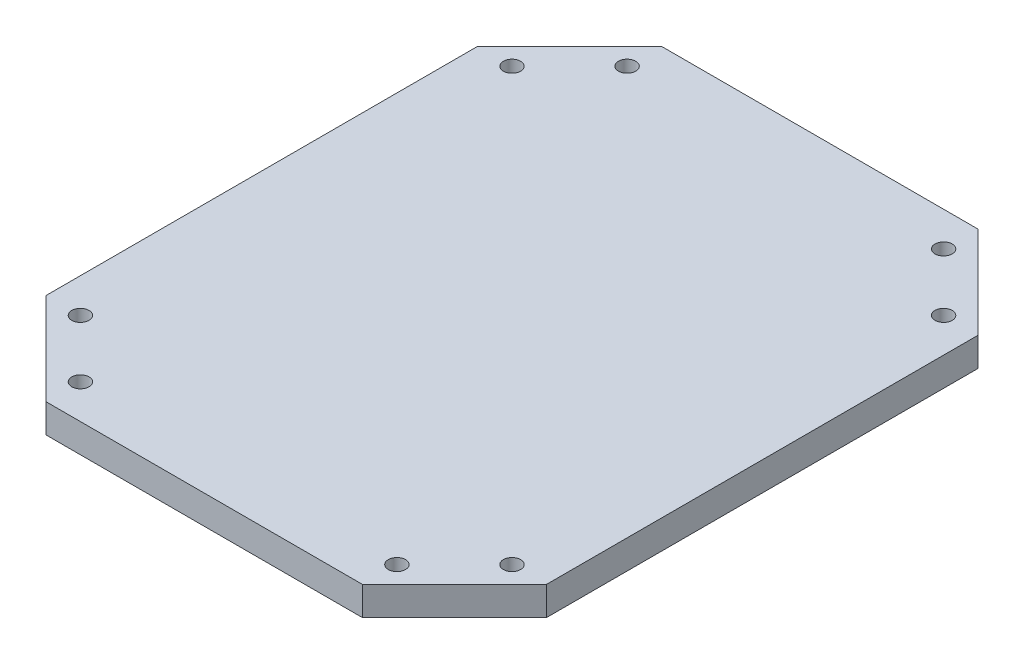
ISO-10303-21;
HEADER;
FILE_DESCRIPTION(('STEP AP214'),'2;1');
FILE_NAME('part.step','',(''),(''),'','','');
FILE_SCHEMA(('AUTOMOTIVE_DESIGN { 1 0 10303 214 1 1 1 1 }'));
ENDSEC;
DATA;
#1=APPLICATION_CONTEXT('core data for automotive mechanical design processes');
#2=APPLICATION_PROTOCOL_DEFINITION('international standard','automotive_design',2000,#1);
#3=PRODUCT_CONTEXT('',#1,'mechanical');
#4=PRODUCT('Part','Part','',(#3));
#5=PRODUCT_RELATED_PRODUCT_CATEGORY('part','',(#4));
#6=PRODUCT_DEFINITION_FORMATION('','',#4);
#7=PRODUCT_DEFINITION_CONTEXT('part definition',#1,'design');
#8=PRODUCT_DEFINITION('design','',#6,#7);
#9=PRODUCT_DEFINITION_SHAPE('','',#8);
#10=(LENGTH_UNIT() NAMED_UNIT(*) SI_UNIT(.MILLI.,.METRE.));
#11=(NAMED_UNIT(*) PLANE_ANGLE_UNIT() SI_UNIT($,.RADIAN.));
#12=(NAMED_UNIT(*) SI_UNIT($,.STERADIAN.) SOLID_ANGLE_UNIT());
#13=UNCERTAINTY_MEASURE_WITH_UNIT(LENGTH_MEASURE(1.E-05),#10,'distance_accuracy_value','');
#14=(GEOMETRIC_REPRESENTATION_CONTEXT(3) GLOBAL_UNCERTAINTY_ASSIGNED_CONTEXT((#13)) GLOBAL_UNIT_ASSIGNED_CONTEXT((#10,
#11,#12)) REPRESENTATION_CONTEXT('',''));
#15=CARTESIAN_POINT('',(0.,0.,0.));
#16=DIRECTION('',(0.,0.,1.));
#17=DIRECTION('',(1.,0.,0.));
#18=AXIS2_PLACEMENT_3D('',#15,#16,#17);
#19=CARTESIAN_POINT('',(0.,5.,0.));
#20=DIRECTION('',(0.,-1.,0.));
#21=DIRECTION('',(0.,0.,-1.));
#22=AXIS2_PLACEMENT_3D('',#19,#20,#21);
#23=PLANE('',#22);
#24=CARTESIAN_POINT('',(44.1466624196848,5.,64.081036485496));
#25=DIRECTION('',(0.,1.,0.));
#26=DIRECTION('',(0.,0.,1.));
#27=AXIS2_PLACEMENT_3D('',#24,#25,#26);
#28=CIRCLE('',#27,1.49999999999999);
#29=CARTESIAN_POINT('',(44.1466624196848,5.,65.581036485496));
#30=VERTEX_POINT('',#29);
#31=EDGE_CURVE('E243',#30,#30,#28,.T.);
#32=ORIENTED_EDGE('',*,*,#31,.F.);
#33=EDGE_LOOP('',(#32));
#34=FACE_BOUND('',#33,.T.);
#35=CARTESIAN_POINT('',(-20.8533375803152,5.,-20.918963514504));
#36=DIRECTION('',(0.,1.,0.));
#37=DIRECTION('',(0.,0.,1.));
#38=AXIS2_PLACEMENT_3D('',#35,#36,#37);
#39=CIRCLE('',#38,1.49999999999999);
#40=CARTESIAN_POINT('',(-20.8533375803152,5.,-19.418963514504));
#41=VERTEX_POINT('',#40);
#42=EDGE_CURVE('E211',#41,#41,#39,.T.);
#43=ORIENTED_EDGE('',*,*,#42,.F.);
#44=EDGE_LOOP('',(#43));
#45=FACE_BOUND('',#44,.T.);
#46=DIRECTION('',(0.,0.,1.));
#47=VECTOR('',#46,1.);
#48=CARTESIAN_POINT('',(-36.8331684754007,5.,64.081036485496));
#49=LINE('',#48,#47);
#50=CARTESIAN_POINT('',(-36.8331684754007,5.,-10.918963514504));
#51=VERTEX_POINT('',#50);
#52=CARTESIAN_POINT('',(-36.8331684754007,5.,64.081036485496));
#53=VERTEX_POINT('',#52);
#54=EDGE_CURVE('E164',#51,#53,#49,.T.);
#55=ORIENTED_EDGE('',*,*,#54,.T.);
#56=DIRECTION('',(0.707106781186547,0.,0.707106781186548));
#57=VECTOR('',#56,1.);
#58=CARTESIAN_POINT('',(-20.8533375803152,5.,80.0608673805815));
#59=LINE('',#58,#57);
#60=CARTESIAN_POINT('',(-20.8533375803152,5.,80.0608673805815));
#61=VERTEX_POINT('',#60);
#62=EDGE_CURVE('E100',#53,#61,#59,.T.);
#63=ORIENTED_EDGE('',*,*,#62,.T.);
#64=DIRECTION('',(1.,0.,0.));
#65=VECTOR('',#64,1.);
#66=CARTESIAN_POINT('',(34.1466624196848,5.,80.0608673805815));
#67=LINE('',#66,#65);
#68=CARTESIAN_POINT('',(34.1466624196848,5.,80.0608673805815));
#69=VERTEX_POINT('',#68);
#70=EDGE_CURVE('E185',#61,#69,#67,.T.);
#71=ORIENTED_EDGE('',*,*,#70,.T.);
#72=DIRECTION('',(0.707106781186547,0.,-0.707106781186548));
#73=VECTOR('',#72,1.);
#74=CARTESIAN_POINT('',(50.1264933147703,5.,64.081036485496));
#75=LINE('',#74,#73);
#76=CARTESIAN_POINT('',(50.1264933147703,5.,64.081036485496));
#77=VERTEX_POINT('',#76);
#78=EDGE_CURVE('E198',#69,#77,#75,.T.);
#79=ORIENTED_EDGE('',*,*,#78,.T.);
#80=DIRECTION('',(0.,0.,-1.));
#81=VECTOR('',#80,1.);
#82=CARTESIAN_POINT('',(50.1264933147703,5.,-10.918963514504));
#83=LINE('',#82,#81);
#84=CARTESIAN_POINT('',(50.1264933147703,5.,-10.918963514504));
#85=VERTEX_POINT('',#84);
#86=EDGE_CURVE('E119',#77,#85,#83,.T.);
#87=ORIENTED_EDGE('',*,*,#86,.T.);
#88=DIRECTION('',(-0.707106781186548,0.,-0.707106781186548));
#89=VECTOR('',#88,1.);
#90=CARTESIAN_POINT('',(34.1466624196848,5.,-26.8987944095895));
#91=LINE('',#90,#89);
#92=CARTESIAN_POINT('',(34.1466624196848,5.,-26.8987944095895));
#93=VERTEX_POINT('',#92);
#94=EDGE_CURVE('E113',#85,#93,#91,.T.);
#95=ORIENTED_EDGE('',*,*,#94,.T.);
#96=DIRECTION('',(-1.,0.,0.));
#97=VECTOR('',#96,1.);
#98=CARTESIAN_POINT('',(-20.8533375803152,5.,-26.8987944095895));
#99=LINE('',#98,#97);
#100=CARTESIAN_POINT('',(-20.8533375803152,5.,-26.8987944095895));
#101=VERTEX_POINT('',#100);
#102=EDGE_CURVE('E117',#93,#101,#99,.T.);
#103=ORIENTED_EDGE('',*,*,#102,.T.);
#104=DIRECTION('',(-0.707106781186548,0.,0.707106781186547));
#105=VECTOR('',#104,1.);
#106=CARTESIAN_POINT('',(-36.8331684754007,5.,-10.918963514504));
#107=LINE('',#106,#105);
#108=EDGE_CURVE('E57',#101,#51,#107,.T.);
#109=ORIENTED_EDGE('',*,*,#108,.T.);
#110=EDGE_LOOP('',(#55,#63,#71,#79,#87,#95,#103,#109));
#111=FACE_BOUND('',#110,.T.);
#112=CARTESIAN_POINT('',(-30.8533375803152,5.,-10.918963514504));
#113=DIRECTION('',(0.,1.,0.));
#114=DIRECTION('',(0.,0.,1.));
#115=AXIS2_PLACEMENT_3D('',#112,#113,#114);
#116=CIRCLE('',#115,1.49999999999999);
#117=CARTESIAN_POINT('',(-30.8533375803152,5.,-9.41896351450401));
#118=VERTEX_POINT('',#117);
#119=EDGE_CURVE('E219',#118,#118,#116,.T.);
#120=ORIENTED_EDGE('',*,*,#119,.F.);
#121=EDGE_LOOP('',(#120));
#122=FACE_BOUND('',#121,.T.);
#123=CARTESIAN_POINT('',(44.1466624196848,5.,-10.918963514504));
#124=DIRECTION('',(0.,1.,0.));
#125=DIRECTION('',(0.,0.,1.));
#126=AXIS2_PLACEMENT_3D('',#123,#124,#125);
#127=CIRCLE('',#126,1.49999999999999);
#128=CARTESIAN_POINT('',(44.1466624196848,5.,-9.41896351450401));
#129=VERTEX_POINT('',#128);
#130=EDGE_CURVE('E227',#129,#129,#127,.T.);
#131=ORIENTED_EDGE('',*,*,#130,.F.);
#132=EDGE_LOOP('',(#131));
#133=FACE_BOUND('',#132,.T.);
#134=CARTESIAN_POINT('',(34.1466624196848,5.,-20.918963514504));
#135=DIRECTION('',(0.,1.,0.));
#136=DIRECTION('',(0.,0.,1.));
#137=AXIS2_PLACEMENT_3D('',#134,#135,#136);
#138=CIRCLE('',#137,1.49999999999999);
#139=CARTESIAN_POINT('',(34.1466624196848,5.,-19.418963514504));
#140=VERTEX_POINT('',#139);
#141=EDGE_CURVE('E235',#140,#140,#138,.T.);
#142=ORIENTED_EDGE('',*,*,#141,.F.);
#143=EDGE_LOOP('',(#142));
#144=FACE_BOUND('',#143,.T.);
#145=CARTESIAN_POINT('',(34.1466624196848,5.,74.081036485496));
#146=DIRECTION('',(0.,1.,0.));
#147=DIRECTION('',(0.,0.,1.));
#148=AXIS2_PLACEMENT_3D('',#145,#146,#147);
#149=CIRCLE('',#148,1.49999999999999);
#150=CARTESIAN_POINT('',(34.1466624196848,5.,75.581036485496));
#151=VERTEX_POINT('',#150);
#152=EDGE_CURVE('E251',#151,#151,#149,.T.);
#153=ORIENTED_EDGE('',*,*,#152,.F.);
#154=EDGE_LOOP('',(#153));
#155=FACE_BOUND('',#154,.T.);
#156=CARTESIAN_POINT('',(-20.8533375803152,5.,74.081036485496));
#157=DIRECTION('',(0.,1.,0.));
#158=DIRECTION('',(0.,0.,1.));
#159=AXIS2_PLACEMENT_3D('',#156,#157,#158);
#160=CIRCLE('',#159,1.49999999999999);
#161=CARTESIAN_POINT('',(-20.8533375803152,5.,75.581036485496));
#162=VERTEX_POINT('',#161);
#163=EDGE_CURVE('E259',#162,#162,#160,.T.);
#164=ORIENTED_EDGE('',*,*,#163,.F.);
#165=EDGE_LOOP('',(#164));
#166=FACE_BOUND('',#165,.T.);
#167=CARTESIAN_POINT('',(-30.8533375803152,5.,64.081036485496));
#168=DIRECTION('',(0.,1.,0.));
#169=DIRECTION('',(0.,0.,1.));
#170=AXIS2_PLACEMENT_3D('',#167,#168,#169);
#171=CIRCLE('',#170,1.49999999999999);
#172=CARTESIAN_POINT('',(-30.8533375803152,5.,65.581036485496));
#173=VERTEX_POINT('',#172);
#174=EDGE_CURVE('E267',#173,#173,#171,.T.);
#175=ORIENTED_EDGE('',*,*,#174,.F.);
#176=EDGE_LOOP('',(#175));
#177=FACE_BOUND('',#176,.T.);
#178=ADVANCED_FACE('F39',(#34,#45,#111,#122,#133,#144,#155,#166,#177),#23,.F.);
#179=CARTESIAN_POINT('',(-36.8331684754007,5.,64.081036485496));
#180=DIRECTION('',(1.,0.,0.));
#181=DIRECTION('',(0.,0.,-1.));
#182=AXIS2_PLACEMENT_3D('',#179,#180,#181);
#183=PLANE('',#182);
#184=DIRECTION('',(0.,0.,1.));
#185=VECTOR('',#184,1.);
#186=CARTESIAN_POINT('',(-36.8331684754007,0.,64.081036485496));
#187=LINE('',#186,#185);
#188=CARTESIAN_POINT('',(-36.8331684754007,0.,-10.918963514504));
#189=VERTEX_POINT('',#188);
#190=CARTESIAN_POINT('',(-36.8331684754007,0.,64.081036485496));
#191=VERTEX_POINT('',#190);
#192=EDGE_CURVE('E141',#189,#191,#187,.T.);
#193=ORIENTED_EDGE('',*,*,#192,.T.);
#194=DIRECTION('',(0.,-1.,0.));
#195=VECTOR('',#194,1.);
#196=CARTESIAN_POINT('',(-36.8331684754007,5.,64.081036485496));
#197=LINE('',#196,#195);
#198=EDGE_CURVE('E11',#53,#191,#197,.T.);
#199=ORIENTED_EDGE('',*,*,#198,.F.);
#200=ORIENTED_EDGE('',*,*,#54,.F.);
#201=DIRECTION('',(0.,-1.,0.));
#202=VECTOR('',#201,1.);
#203=CARTESIAN_POINT('',(-36.8331684754007,5.,-10.918963514504));
#204=LINE('',#203,#202);
#205=EDGE_CURVE('E137',#51,#189,#204,.T.);
#206=ORIENTED_EDGE('',*,*,#205,.T.);
#207=EDGE_LOOP('',(#193,#199,#200,#206));
#208=FACE_BOUND('',#207,.T.);
#209=ADVANCED_FACE('F41',(#208),#183,.F.);
#210=CARTESIAN_POINT('',(-20.8533375803152,5.,80.0608673805815));
#211=DIRECTION('',(0.707106781186548,0.,-0.707106781186547));
#212=DIRECTION('',(-0.707106781186547,0.,-0.707106781186548));
#213=AXIS2_PLACEMENT_3D('',#210,#211,#212);
#214=PLANE('',#213);
#215=DIRECTION('',(0.707106781186547,0.,0.707106781186548));
#216=VECTOR('',#215,1.);
#217=CARTESIAN_POINT('',(-20.8533375803152,0.,80.0608673805815));
#218=LINE('',#217,#216);
#219=CARTESIAN_POINT('',(-20.8533375803152,0.,80.0608673805815));
#220=VERTEX_POINT('',#219);
#221=EDGE_CURVE('E145',#191,#220,#218,.T.);
#222=ORIENTED_EDGE('',*,*,#221,.T.);
#223=DIRECTION('',(0.,-1.,0.));
#224=VECTOR('',#223,1.);
#225=CARTESIAN_POINT('',(-20.8533375803152,5.,80.0608673805815));
#226=LINE('',#225,#224);
#227=EDGE_CURVE('E49',#61,#220,#226,.T.);
#228=ORIENTED_EDGE('',*,*,#227,.F.);
#229=ORIENTED_EDGE('',*,*,#62,.F.);
#230=ORIENTED_EDGE('',*,*,#198,.T.);
#231=EDGE_LOOP('',(#222,#228,#229,#230));
#232=FACE_BOUND('',#231,.T.);
#233=ADVANCED_FACE('F281',(#232),#214,.F.);
#234=CARTESIAN_POINT('',(34.1466624196848,5.,80.0608673805815));
#235=DIRECTION('',(0.,0.,-1.));
#236=DIRECTION('',(-1.,0.,0.));
#237=AXIS2_PLACEMENT_3D('',#234,#235,#236);
#238=PLANE('',#237);
#239=DIRECTION('',(1.,0.,0.));
#240=VECTOR('',#239,1.);
#241=CARTESIAN_POINT('',(34.1466624196848,0.,80.0608673805815));
#242=LINE('',#241,#240);
#243=CARTESIAN_POINT('',(34.1466624196848,0.,80.0608673805815));
#244=VERTEX_POINT('',#243);
#245=EDGE_CURVE('E149',#220,#244,#242,.T.);
#246=ORIENTED_EDGE('',*,*,#245,.T.);
#247=DIRECTION('',(0.,-1.,0.));
#248=VECTOR('',#247,1.);
#249=CARTESIAN_POINT('',(34.1466624196848,5.,80.0608673805815));
#250=LINE('',#249,#248);
#251=EDGE_CURVE('E175',#69,#244,#250,.T.);
#252=ORIENTED_EDGE('',*,*,#251,.F.);
#253=ORIENTED_EDGE('',*,*,#70,.F.);
#254=ORIENTED_EDGE('',*,*,#227,.T.);
#255=EDGE_LOOP('',(#246,#252,#253,#254));
#256=FACE_BOUND('',#255,.T.);
#257=ADVANCED_FACE('F183',(#256),#238,.F.);
#258=CARTESIAN_POINT('',(50.1264933147703,5.,64.081036485496));
#259=DIRECTION('',(-0.707106781186548,0.,-0.707106781186547));
#260=DIRECTION('',(-0.707106781186547,0.,0.707106781186548));
#261=AXIS2_PLACEMENT_3D('',#258,#259,#260);
#262=PLANE('',#261);
#263=DIRECTION('',(0.707106781186547,0.,-0.707106781186548));
#264=VECTOR('',#263,1.);
#265=CARTESIAN_POINT('',(50.1264933147703,0.,64.081036485496));
#266=LINE('',#265,#264);
#267=CARTESIAN_POINT('',(50.1264933147703,0.,64.081036485496));
#268=VERTEX_POINT('',#267);
#269=EDGE_CURVE('E152',#244,#268,#266,.T.);
#270=ORIENTED_EDGE('',*,*,#269,.T.);
#271=DIRECTION('',(0.,-1.,0.));
#272=VECTOR('',#271,1.);
#273=CARTESIAN_POINT('',(50.1264933147703,5.,64.081036485496));
#274=LINE('',#273,#272);
#275=EDGE_CURVE('E171',#77,#268,#274,.T.);
#276=ORIENTED_EDGE('',*,*,#275,.F.);
#277=ORIENTED_EDGE('',*,*,#78,.F.);
#278=ORIENTED_EDGE('',*,*,#251,.T.);
#279=EDGE_LOOP('',(#270,#276,#277,#278));
#280=FACE_BOUND('',#279,.T.);
#281=ADVANCED_FACE('F193',(#280),#262,.F.);
#282=CARTESIAN_POINT('',(50.1264933147703,5.,-10.918963514504));
#283=DIRECTION('',(-1.,0.,0.));
#284=DIRECTION('',(0.,0.,1.));
#285=AXIS2_PLACEMENT_3D('',#282,#283,#284);
#286=PLANE('',#285);
#287=DIRECTION('',(0.,0.,-1.));
#288=VECTOR('',#287,1.);
#289=CARTESIAN_POINT('',(50.1264933147703,0.,-10.918963514504));
#290=LINE('',#289,#288);
#291=CARTESIAN_POINT('',(50.1264933147703,0.,-10.918963514504));
#292=VERTEX_POINT('',#291);
#293=EDGE_CURVE('E155',#268,#292,#290,.T.);
#294=ORIENTED_EDGE('',*,*,#293,.T.);
#295=DIRECTION('',(0.,-1.,0.));
#296=VECTOR('',#295,1.);
#297=CARTESIAN_POINT('',(50.1264933147703,5.,-10.918963514504));
#298=LINE('',#297,#296);
#299=EDGE_CURVE('E130',#85,#292,#298,.T.);
#300=ORIENTED_EDGE('',*,*,#299,.F.);
#301=ORIENTED_EDGE('',*,*,#86,.F.);
#302=ORIENTED_EDGE('',*,*,#275,.T.);
#303=EDGE_LOOP('',(#294,#300,#301,#302));
#304=FACE_BOUND('',#303,.T.);
#305=ADVANCED_FACE('F196',(#304),#286,.F.);
#306=CARTESIAN_POINT('',(34.1466624196848,5.,-26.8987944095895));
#307=DIRECTION('',(-0.707106781186548,0.,0.707106781186548));
#308=DIRECTION('',(0.707106781186548,0.,0.707106781186548));
#309=AXIS2_PLACEMENT_3D('',#306,#307,#308);
#310=PLANE('',#309);
#311=DIRECTION('',(-0.707106781186548,0.,-0.707106781186548));
#312=VECTOR('',#311,1.);
#313=CARTESIAN_POINT('',(34.1466624196848,0.,-26.8987944095895));
#314=LINE('',#313,#312);
#315=CARTESIAN_POINT('',(34.1466624196848,0.,-26.8987944095895));
#316=VERTEX_POINT('',#315);
#317=EDGE_CURVE('E128',#292,#316,#314,.T.);
#318=ORIENTED_EDGE('',*,*,#317,.T.);
#319=DIRECTION('',(0.,-1.,0.));
#320=VECTOR('',#319,1.);
#321=CARTESIAN_POINT('',(34.1466624196848,5.,-26.8987944095895));
#322=LINE('',#321,#320);
#323=EDGE_CURVE('E125',#93,#316,#322,.T.);
#324=ORIENTED_EDGE('',*,*,#323,.F.);
#325=ORIENTED_EDGE('',*,*,#94,.F.);
#326=ORIENTED_EDGE('',*,*,#299,.T.);
#327=EDGE_LOOP('',(#318,#324,#325,#326));
#328=FACE_BOUND('',#327,.T.);
#329=ADVANCED_FACE('F126',(#328),#310,.F.);
#330=CARTESIAN_POINT('',(-20.8533375803152,5.,-26.8987944095895));
#331=DIRECTION('',(0.,0.,1.));
#332=DIRECTION('',(1.,0.,0.));
#333=AXIS2_PLACEMENT_3D('',#330,#331,#332);
#334=PLANE('',#333);
#335=DIRECTION('',(-1.,0.,0.));
#336=VECTOR('',#335,1.);
#337=CARTESIAN_POINT('',(-20.8533375803152,0.,-26.8987944095895));
#338=LINE('',#337,#336);
#339=CARTESIAN_POINT('',(-20.8533375803152,0.,-26.8987944095895));
#340=VERTEX_POINT('',#339);
#341=EDGE_CURVE('E86',#316,#340,#338,.T.);
#342=ORIENTED_EDGE('',*,*,#341,.T.);
#343=DIRECTION('',(0.,-1.,0.));
#344=VECTOR('',#343,1.);
#345=CARTESIAN_POINT('',(-20.8533375803152,5.,-26.8987944095895));
#346=LINE('',#345,#344);
#347=EDGE_CURVE('E131',#101,#340,#346,.T.);
#348=ORIENTED_EDGE('',*,*,#347,.F.);
#349=ORIENTED_EDGE('',*,*,#102,.F.);
#350=ORIENTED_EDGE('',*,*,#323,.T.);
#351=EDGE_LOOP('',(#342,#348,#349,#350));
#352=FACE_BOUND('',#351,.T.);
#353=ADVANCED_FACE('F133',(#352),#334,.F.);
#354=CARTESIAN_POINT('',(-36.8331684754007,5.,-10.918963514504));
#355=DIRECTION('',(0.707106781186547,0.,0.707106781186548));
#356=DIRECTION('',(0.707106781186548,0.,-0.707106781186547));
#357=AXIS2_PLACEMENT_3D('',#354,#355,#356);
#358=PLANE('',#357);
#359=DIRECTION('',(-0.707106781186548,0.,0.707106781186547));
#360=VECTOR('',#359,1.);
#361=CARTESIAN_POINT('',(-36.8331684754007,0.,-10.918963514504));
#362=LINE('',#361,#360);
#363=EDGE_CURVE('E92',#340,#189,#362,.T.);
#364=ORIENTED_EDGE('',*,*,#363,.T.);
#365=ORIENTED_EDGE('',*,*,#205,.F.);
#366=ORIENTED_EDGE('',*,*,#108,.F.);
#367=ORIENTED_EDGE('',*,*,#347,.T.);
#368=EDGE_LOOP('',(#364,#365,#366,#367));
#369=FACE_BOUND('',#368,.T.);
#370=ADVANCED_FACE('F291',(#369),#358,.F.);
#371=CARTESIAN_POINT('',(0.,0.,0.));
#372=DIRECTION('',(0.,-1.,0.));
#373=DIRECTION('',(0.,0.,-1.));
#374=AXIS2_PLACEMENT_3D('',#371,#372,#373);
#375=PLANE('',#374);
#376=CARTESIAN_POINT('',(-30.8533375803152,0.,64.081036485496));
#377=DIRECTION('',(0.,-1.,0.));
#378=DIRECTION('',(0.,0.,-1.));
#379=AXIS2_PLACEMENT_3D('',#376,#377,#378);
#380=CIRCLE('',#379,1.49999999999999);
#381=CARTESIAN_POINT('',(-30.8533375803152,0.,62.581036485496));
#382=VERTEX_POINT('',#381);
#383=EDGE_CURVE('E263',#382,#382,#380,.T.);
#384=ORIENTED_EDGE('',*,*,#383,.F.);
#385=EDGE_LOOP('',(#384));
#386=FACE_BOUND('',#385,.T.);
#387=CARTESIAN_POINT('',(-20.8533375803152,0.,74.081036485496));
#388=DIRECTION('',(0.,-1.,0.));
#389=DIRECTION('',(0.,0.,-1.));
#390=AXIS2_PLACEMENT_3D('',#387,#388,#389);
#391=CIRCLE('',#390,1.49999999999999);
#392=CARTESIAN_POINT('',(-20.8533375803152,0.,72.581036485496));
#393=VERTEX_POINT('',#392);
#394=EDGE_CURVE('E255',#393,#393,#391,.T.);
#395=ORIENTED_EDGE('',*,*,#394,.F.);
#396=EDGE_LOOP('',(#395));
#397=FACE_BOUND('',#396,.T.);
#398=CARTESIAN_POINT('',(34.1466624196848,0.,74.081036485496));
#399=DIRECTION('',(0.,-1.,0.));
#400=DIRECTION('',(0.,0.,-1.));
#401=AXIS2_PLACEMENT_3D('',#398,#399,#400);
#402=CIRCLE('',#401,1.49999999999999);
#403=CARTESIAN_POINT('',(34.1466624196848,0.,72.581036485496));
#404=VERTEX_POINT('',#403);
#405=EDGE_CURVE('E247',#404,#404,#402,.T.);
#406=ORIENTED_EDGE('',*,*,#405,.F.);
#407=EDGE_LOOP('',(#406));
#408=FACE_BOUND('',#407,.T.);
#409=CARTESIAN_POINT('',(44.1466624196848,0.,64.081036485496));
#410=DIRECTION('',(0.,-1.,0.));
#411=DIRECTION('',(0.,0.,-1.));
#412=AXIS2_PLACEMENT_3D('',#409,#410,#411);
#413=CIRCLE('',#412,1.49999999999999);
#414=CARTESIAN_POINT('',(44.1466624196848,0.,62.581036485496));
#415=VERTEX_POINT('',#414);
#416=EDGE_CURVE('E239',#415,#415,#413,.T.);
#417=ORIENTED_EDGE('',*,*,#416,.F.);
#418=EDGE_LOOP('',(#417));
#419=FACE_BOUND('',#418,.T.);
#420=CARTESIAN_POINT('',(34.1466624196848,0.,-20.918963514504));
#421=DIRECTION('',(0.,-1.,0.));
#422=DIRECTION('',(0.,0.,-1.));
#423=AXIS2_PLACEMENT_3D('',#420,#421,#422);
#424=CIRCLE('',#423,1.49999999999999);
#425=CARTESIAN_POINT('',(34.1466624196848,0.,-22.418963514504));
#426=VERTEX_POINT('',#425);
#427=EDGE_CURVE('E231',#426,#426,#424,.T.);
#428=ORIENTED_EDGE('',*,*,#427,.F.);
#429=EDGE_LOOP('',(#428));
#430=FACE_BOUND('',#429,.T.);
#431=CARTESIAN_POINT('',(44.1466624196848,0.,-10.918963514504));
#432=DIRECTION('',(0.,-1.,0.));
#433=DIRECTION('',(0.,0.,-1.));
#434=AXIS2_PLACEMENT_3D('',#431,#432,#433);
#435=CIRCLE('',#434,1.49999999999999);
#436=CARTESIAN_POINT('',(44.1466624196848,0.,-12.418963514504));
#437=VERTEX_POINT('',#436);
#438=EDGE_CURVE('E223',#437,#437,#435,.T.);
#439=ORIENTED_EDGE('',*,*,#438,.F.);
#440=EDGE_LOOP('',(#439));
#441=FACE_BOUND('',#440,.T.);
#442=CARTESIAN_POINT('',(-30.8533375803152,0.,-10.918963514504));
#443=DIRECTION('',(0.,-1.,0.));
#444=DIRECTION('',(0.,0.,-1.));
#445=AXIS2_PLACEMENT_3D('',#442,#443,#444);
#446=CIRCLE('',#445,1.49999999999999);
#447=CARTESIAN_POINT('',(-30.8533375803152,0.,-12.418963514504));
#448=VERTEX_POINT('',#447);
#449=EDGE_CURVE('E215',#448,#448,#446,.T.);
#450=ORIENTED_EDGE('',*,*,#449,.F.);
#451=EDGE_LOOP('',(#450));
#452=FACE_BOUND('',#451,.T.);
#453=CARTESIAN_POINT('',(-20.8533375803152,0.,-20.918963514504));
#454=DIRECTION('',(0.,-1.,0.));
#455=DIRECTION('',(0.,0.,-1.));
#456=AXIS2_PLACEMENT_3D('',#453,#454,#455);
#457=CIRCLE('',#456,1.49999999999999);
#458=CARTESIAN_POINT('',(-20.8533375803152,0.,-22.418963514504));
#459=VERTEX_POINT('',#458);
#460=EDGE_CURVE('E146',#459,#459,#457,.T.);
#461=ORIENTED_EDGE('',*,*,#460,.F.);
#462=EDGE_LOOP('',(#461));
#463=FACE_BOUND('',#462,.T.);
#464=ORIENTED_EDGE('',*,*,#192,.F.);
#465=ORIENTED_EDGE('',*,*,#363,.F.);
#466=ORIENTED_EDGE('',*,*,#341,.F.);
#467=ORIENTED_EDGE('',*,*,#317,.F.);
#468=ORIENTED_EDGE('',*,*,#293,.F.);
#469=ORIENTED_EDGE('',*,*,#269,.F.);
#470=ORIENTED_EDGE('',*,*,#245,.F.);
#471=ORIENTED_EDGE('',*,*,#221,.F.);
#472=EDGE_LOOP('',(#464,#465,#466,#467,#468,#469,#470,#471));
#473=FACE_BOUND('',#472,.T.);
#474=ADVANCED_FACE('F189',(#386,#397,#408,#419,#430,#441,#452,#463,#473),#375,.T.);
#475=CARTESIAN_POINT('',(-20.8533375803152,5.,-20.918963514504));
#476=DIRECTION('',(0.,1.,0.));
#477=DIRECTION('',(0.,0.,1.));
#478=AXIS2_PLACEMENT_3D('',#475,#476,#477);
#479=CYLINDRICAL_SURFACE('',#478,1.49999999999999);
#480=ORIENTED_EDGE('',*,*,#42,.T.);
#481=EDGE_LOOP('',(#480));
#482=FACE_BOUND('',#481,.T.);
#483=ORIENTED_EDGE('',*,*,#460,.T.);
#484=EDGE_LOOP('',(#483));
#485=FACE_BOUND('',#484,.T.);
#486=ADVANCED_FACE('F287',(#482,#485),#479,.F.);
#487=CARTESIAN_POINT('',(-30.8533375803152,5.,-10.918963514504));
#488=DIRECTION('',(0.,1.,0.));
#489=DIRECTION('',(0.,0.,1.));
#490=AXIS2_PLACEMENT_3D('',#487,#488,#489);
#491=CYLINDRICAL_SURFACE('',#490,1.49999999999999);
#492=ORIENTED_EDGE('',*,*,#119,.T.);
#493=EDGE_LOOP('',(#492));
#494=FACE_BOUND('',#493,.T.);
#495=ORIENTED_EDGE('',*,*,#449,.T.);
#496=EDGE_LOOP('',(#495));
#497=FACE_BOUND('',#496,.T.);
#498=ADVANCED_FACE('F346',(#494,#497),#491,.F.);
#499=CARTESIAN_POINT('',(44.1466624196848,5.,-10.918963514504));
#500=DIRECTION('',(0.,1.,0.));
#501=DIRECTION('',(0.,0.,1.));
#502=AXIS2_PLACEMENT_3D('',#499,#500,#501);
#503=CYLINDRICAL_SURFACE('',#502,1.49999999999999);
#504=ORIENTED_EDGE('',*,*,#130,.T.);
#505=EDGE_LOOP('',(#504));
#506=FACE_BOUND('',#505,.T.);
#507=ORIENTED_EDGE('',*,*,#438,.T.);
#508=EDGE_LOOP('',(#507));
#509=FACE_BOUND('',#508,.T.);
#510=ADVANCED_FACE('F353',(#506,#509),#503,.F.);
#511=CARTESIAN_POINT('',(34.1466624196848,5.,-20.918963514504));
#512=DIRECTION('',(0.,1.,0.));
#513=DIRECTION('',(0.,0.,1.));
#514=AXIS2_PLACEMENT_3D('',#511,#512,#513);
#515=CYLINDRICAL_SURFACE('',#514,1.49999999999999);
#516=ORIENTED_EDGE('',*,*,#141,.T.);
#517=EDGE_LOOP('',(#516));
#518=FACE_BOUND('',#517,.T.);
#519=ORIENTED_EDGE('',*,*,#427,.T.);
#520=EDGE_LOOP('',(#519));
#521=FACE_BOUND('',#520,.T.);
#522=ADVANCED_FACE('F360',(#518,#521),#515,.F.);
#523=CARTESIAN_POINT('',(44.1466624196848,5.,64.081036485496));
#524=DIRECTION('',(0.,1.,0.));
#525=DIRECTION('',(0.,0.,1.));
#526=AXIS2_PLACEMENT_3D('',#523,#524,#525);
#527=CYLINDRICAL_SURFACE('',#526,1.49999999999999);
#528=ORIENTED_EDGE('',*,*,#31,.T.);
#529=EDGE_LOOP('',(#528));
#530=FACE_BOUND('',#529,.T.);
#531=ORIENTED_EDGE('',*,*,#416,.T.);
#532=EDGE_LOOP('',(#531));
#533=FACE_BOUND('',#532,.T.);
#534=ADVANCED_FACE('F368',(#530,#533),#527,.F.);
#535=CARTESIAN_POINT('',(34.1466624196848,5.,74.081036485496));
#536=DIRECTION('',(0.,1.,0.));
#537=DIRECTION('',(0.,0.,1.));
#538=AXIS2_PLACEMENT_3D('',#535,#536,#537);
#539=CYLINDRICAL_SURFACE('',#538,1.49999999999999);
#540=ORIENTED_EDGE('',*,*,#152,.T.);
#541=EDGE_LOOP('',(#540));
#542=FACE_BOUND('',#541,.T.);
#543=ORIENTED_EDGE('',*,*,#405,.T.);
#544=EDGE_LOOP('',(#543));
#545=FACE_BOUND('',#544,.T.);
#546=ADVANCED_FACE('F375',(#542,#545),#539,.F.);
#547=CARTESIAN_POINT('',(-20.8533375803152,5.,74.081036485496));
#548=DIRECTION('',(0.,1.,0.));
#549=DIRECTION('',(0.,0.,1.));
#550=AXIS2_PLACEMENT_3D('',#547,#548,#549);
#551=CYLINDRICAL_SURFACE('',#550,1.49999999999999);
#552=ORIENTED_EDGE('',*,*,#163,.T.);
#553=EDGE_LOOP('',(#552));
#554=FACE_BOUND('',#553,.T.);
#555=ORIENTED_EDGE('',*,*,#394,.T.);
#556=EDGE_LOOP('',(#555));
#557=FACE_BOUND('',#556,.T.);
#558=ADVANCED_FACE('F383',(#554,#557),#551,.F.);
#559=CARTESIAN_POINT('',(-30.8533375803152,5.,64.081036485496));
#560=DIRECTION('',(0.,1.,0.));
#561=DIRECTION('',(0.,0.,1.));
#562=AXIS2_PLACEMENT_3D('',#559,#560,#561);
#563=CYLINDRICAL_SURFACE('',#562,1.49999999999999);
#564=ORIENTED_EDGE('',*,*,#174,.T.);
#565=EDGE_LOOP('',(#564));
#566=FACE_BOUND('',#565,.T.);
#567=ORIENTED_EDGE('',*,*,#383,.T.);
#568=EDGE_LOOP('',(#567));
#569=FACE_BOUND('',#568,.T.);
#570=ADVANCED_FACE('F272',(#566,#569),#563,.F.);
#571=CLOSED_SHELL('',(#178,#209,#233,#257,#281,#305,#329,#353,#370,#474,#486,#498,#510,#522,
#534,#546,#558,#570));
#572=MANIFOLD_SOLID_BREP('B2',#571);
#573=ADVANCED_BREP_SHAPE_REPRESENTATION('',(#18,#572),#14);
#574=SHAPE_DEFINITION_REPRESENTATION(#9,#573);
ENDSEC;
END-ISO-10303-21;
